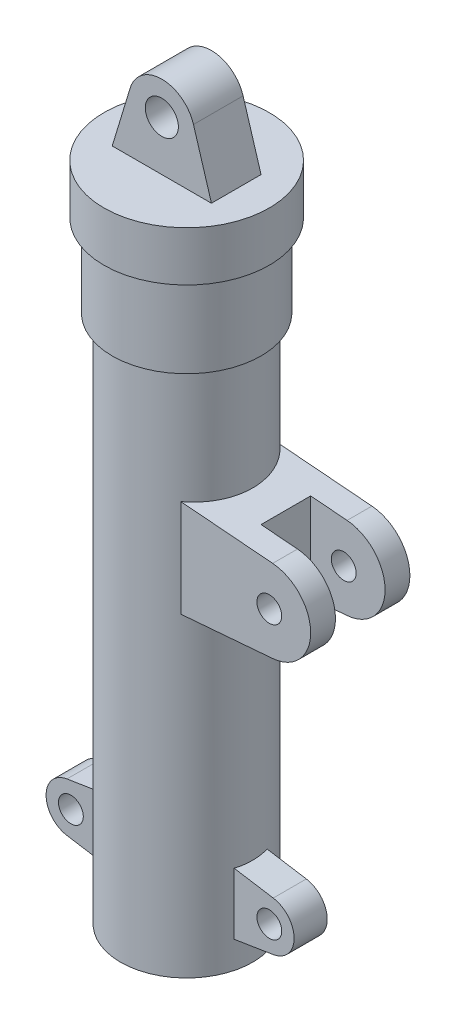
ISO-10303-21;
HEADER;
FILE_DESCRIPTION(('STEP AP214'),'2;1');
FILE_NAME('part.step','',(''),(''),'','','');
FILE_SCHEMA(('AUTOMOTIVE_DESIGN { 1 0 10303 214 1 1 1 1 }'));
ENDSEC;
DATA;
#1=APPLICATION_CONTEXT('core data for automotive mechanical design processes');
#2=APPLICATION_PROTOCOL_DEFINITION('international standard','automotive_design',2000,#1);
#3=PRODUCT_CONTEXT('',#1,'mechanical');
#4=PRODUCT('Part','Part','',(#3));
#5=PRODUCT_RELATED_PRODUCT_CATEGORY('part','',(#4));
#6=PRODUCT_DEFINITION_FORMATION('','',#4);
#7=PRODUCT_DEFINITION_CONTEXT('part definition',#1,'design');
#8=PRODUCT_DEFINITION('design','',#6,#7);
#9=PRODUCT_DEFINITION_SHAPE('','',#8);
#10=(LENGTH_UNIT() NAMED_UNIT(*) SI_UNIT(.MILLI.,.METRE.));
#11=(NAMED_UNIT(*) PLANE_ANGLE_UNIT() SI_UNIT($,.RADIAN.));
#12=(NAMED_UNIT(*) SI_UNIT($,.STERADIAN.) SOLID_ANGLE_UNIT());
#13=UNCERTAINTY_MEASURE_WITH_UNIT(LENGTH_MEASURE(1.E-05),#10,'distance_accuracy_value','');
#14=(GEOMETRIC_REPRESENTATION_CONTEXT(3) GLOBAL_UNCERTAINTY_ASSIGNED_CONTEXT((#13)) GLOBAL_UNIT_ASSIGNED_CONTEXT((#10,
#11,#12)) REPRESENTATION_CONTEXT('',''));
#15=CARTESIAN_POINT('',(0.,0.,0.));
#16=DIRECTION('',(0.,0.,1.));
#17=DIRECTION('',(1.,0.,0.));
#18=AXIS2_PLACEMENT_3D('',#15,#16,#17);
#19=CARTESIAN_POINT('',(80.,-110.,30.));
#20=DIRECTION('',(0.,0.,-1.));
#21=DIRECTION('',(-1.,0.,0.));
#22=AXIS2_PLACEMENT_3D('',#19,#20,#21);
#23=CYLINDRICAL_SURFACE('',#22,25.);
#24=DIRECTION('',(0.,0.,-1.));
#25=VECTOR('',#24,1.);
#26=CARTESIAN_POINT('',(82.0415829983239,-134.916499329981,30.));
#27=LINE('',#26,#25);
#28=CARTESIAN_POINT('',(82.0415829983239,-134.916499329981,30.));
#29=VERTEX_POINT('',#28);
#30=CARTESIAN_POINT('',(82.0415829983239,-134.916499329981,15.));
#31=VERTEX_POINT('',#30);
#32=EDGE_CURVE('E238',#29,#31,#27,.T.);
#33=ORIENTED_EDGE('',*,*,#32,.T.);
#34=CARTESIAN_POINT('',(80.,-110.,15.));
#35=DIRECTION('',(0.,0.,-1.));
#36=DIRECTION('',(-1.,0.,0.));
#37=AXIS2_PLACEMENT_3D('',#34,#35,#36);
#38=CIRCLE('',#37,25.);
#39=CARTESIAN_POINT('',(82.0415829983239,-85.0835006700188,15.));
#40=VERTEX_POINT('',#39);
#41=EDGE_CURVE('E198',#31,#40,#38,.F.);
#42=ORIENTED_EDGE('',*,*,#41,.T.);
#43=DIRECTION('',(0.,0.,-1.));
#44=VECTOR('',#43,1.);
#45=CARTESIAN_POINT('',(82.0415829983239,-85.0835006700188,30.));
#46=LINE('',#45,#44);
#47=CARTESIAN_POINT('',(82.0415829983239,-85.0835006700188,30.));
#48=VERTEX_POINT('',#47);
#49=EDGE_CURVE('E197',#48,#40,#46,.T.);
#50=ORIENTED_EDGE('',*,*,#49,.F.);
#51=CARTESIAN_POINT('',(80.,-110.,30.));
#52=DIRECTION('',(0.,0.,-1.));
#53=DIRECTION('',(-1.,0.,0.));
#54=AXIS2_PLACEMENT_3D('',#51,#52,#53);
#55=CIRCLE('',#54,25.);
#56=EDGE_CURVE('E223',#48,#29,#55,.T.);
#57=ORIENTED_EDGE('',*,*,#56,.T.);
#58=EDGE_LOOP('',(#33,#42,#50,#57));
#59=FACE_BOUND('',#58,.T.);
#60=ADVANCED_FACE('F46',(#59),#23,.T.);
#61=CARTESIAN_POINT('',(80.,-110.,30.));
#62=DIRECTION('',(0.,0.,-1.));
#63=DIRECTION('',(-1.,0.,0.));
#64=AXIS2_PLACEMENT_3D('',#61,#62,#63);
#65=CYLINDRICAL_SURFACE('',#64,7.5);
#66=CARTESIAN_POINT('',(80.,-110.,30.));
#67=DIRECTION('',(0.,0.,1.));
#68=DIRECTION('',(1.,0.,0.));
#69=AXIS2_PLACEMENT_3D('',#66,#67,#68);
#70=CIRCLE('',#69,7.5);
#71=CARTESIAN_POINT('',(87.5,-110.,30.));
#72=VERTEX_POINT('',#71);
#73=EDGE_CURVE('E215',#72,#72,#70,.T.);
#74=ORIENTED_EDGE('',*,*,#73,.T.);
#75=EDGE_LOOP('',(#74));
#76=FACE_BOUND('',#75,.T.);
#77=CARTESIAN_POINT('',(80.,-110.,15.));
#78=DIRECTION('',(0.,0.,-1.));
#79=DIRECTION('',(-1.,0.,0.));
#80=AXIS2_PLACEMENT_3D('',#77,#78,#79);
#81=CIRCLE('',#80,7.5);
#82=CARTESIAN_POINT('',(72.5,-110.,15.));
#83=VERTEX_POINT('',#82);
#84=EDGE_CURVE('E202',#83,#83,#81,.T.);
#85=ORIENTED_EDGE('',*,*,#84,.T.);
#86=EDGE_LOOP('',(#85));
#87=FACE_BOUND('',#86,.T.);
#88=ADVANCED_FACE('F407',(#76,#87),#65,.F.);
#89=CARTESIAN_POINT('',(0.,100.,0.));
#90=DIRECTION('',(0.,1.,0.));
#91=DIRECTION('',(0.,0.,1.));
#92=AXIS2_PLACEMENT_3D('',#89,#90,#91);
#93=CYLINDRICAL_SURFACE('',#92,40.);
#94=CARTESIAN_POINT('',(0.,-330.,0.));
#95=DIRECTION('',(0.,1.,0.));
#96=DIRECTION('',(0.,0.,1.));
#97=AXIS2_PLACEMENT_3D('',#94,#95,#96);
#98=CIRCLE('',#97,39.9999999999999);
#99=CARTESIAN_POINT('',(0.,-330.,39.9999999999999));
#100=VERTEX_POINT('',#99);
#101=EDGE_CURVE('E385',#100,#100,#98,.T.);
#102=ORIENTED_EDGE('',*,*,#101,.T.);
#103=EDGE_LOOP('',(#102));
#104=FACE_BOUND('',#103,.T.);
#105=CARTESIAN_POINT('',(0.,-9.99999999999999,0.));
#106=DIRECTION('',(0.,1.,0.));
#107=DIRECTION('',(0.,0.,1.));
#108=AXIS2_PLACEMENT_3D('',#105,#106,#107);
#109=CIRCLE('',#108,40.);
#110=CARTESIAN_POINT('',(0.,-9.99999999999999,40.));
#111=VERTEX_POINT('',#110);
#112=EDGE_CURVE('E381',#111,#111,#109,.T.);
#113=ORIENTED_EDGE('',*,*,#112,.F.);
#114=EDGE_LOOP('',(#113));
#115=FACE_BOUND('',#114,.T.);
#116=DIRECTION('',(0.,1.,0.));
#117=VECTOR('',#116,1.);
#118=CARTESIAN_POINT('',(38.7298334620741,100.,-10.));
#119=LINE('',#118,#117);
#120=CARTESIAN_POINT('',(38.7298334620741,-313.600742062039,-10.));
#121=VERTEX_POINT('',#120);
#122=CARTESIAN_POINT('',(38.7298334620742,-276.399257937961,-10.));
#123=VERTEX_POINT('',#122);
#124=EDGE_CURVE('E317',#121,#123,#119,.T.);
#125=ORIENTED_EDGE('',*,*,#124,.F.);
#126=CARTESIAN_POINT('',(0.,-319.808538252327,0.));
#127=DIRECTION('',(-0.158264501869385,0.987396752804077,0.));
#128=DIRECTION('',(0.987396752804077,0.158264501869385,0.));
#129=AXIS2_PLACEMENT_3D('',#126,#127,#128);
#130=ELLIPSE('',#129,40.5105646604622,40.);
#131=CARTESIAN_POINT('',(38.7298334620741,-313.600742062039,10.));
#132=VERTEX_POINT('',#131);
#133=EDGE_CURVE('E314',#121,#132,#130,.F.);
#134=ORIENTED_EDGE('',*,*,#133,.T.);
#135=DIRECTION('',(0.,1.,0.));
#136=VECTOR('',#135,1.);
#137=CARTESIAN_POINT('',(38.7298334620741,100.,10.));
#138=LINE('',#137,#136);
#139=CARTESIAN_POINT('',(38.7298334620742,-276.399257937961,10.));
#140=VERTEX_POINT('',#139);
#141=EDGE_CURVE('E320',#132,#140,#138,.T.);
#142=ORIENTED_EDGE('',*,*,#141,.T.);
#143=CARTESIAN_POINT('',(0.,-270.191461747673,0.));
#144=DIRECTION('',(-0.158264501869385,-0.987396752804077,0.));
#145=DIRECTION('',(-0.987396752804077,0.158264501869385,0.));
#146=AXIS2_PLACEMENT_3D('',#143,#144,#145);
#147=ELLIPSE('',#146,40.5105646604622,40.);
#148=EDGE_CURVE('E311',#140,#123,#147,.F.);
#149=ORIENTED_EDGE('',*,*,#148,.T.);
#150=EDGE_LOOP('',(#125,#134,#142,#149));
#151=FACE_BOUND('',#150,.T.);
#152=CARTESIAN_POINT('',(0.,-270.191461747673,0.));
#153=DIRECTION('',(-0.158264501869385,0.987396752804077,0.));
#154=DIRECTION('',(0.987396752804077,0.158264501869385,0.));
#155=AXIS2_PLACEMENT_3D('',#152,#153,#154);
#156=ELLIPSE('',#155,40.5105646604622,40.);
#157=CARTESIAN_POINT('',(-38.7298334620742,-276.399257937961,10.));
#158=VERTEX_POINT('',#157);
#159=CARTESIAN_POINT('',(-38.7298334620741,-276.399257937961,-10.));
#160=VERTEX_POINT('',#159);
#161=EDGE_CURVE('E282',#158,#160,#156,.F.);
#162=ORIENTED_EDGE('',*,*,#161,.F.);
#163=DIRECTION('',(0.,1.,0.));
#164=VECTOR('',#163,1.);
#165=CARTESIAN_POINT('',(-38.7298334620741,100.,10.));
#166=LINE('',#165,#164);
#167=CARTESIAN_POINT('',(-38.7298334620741,-313.600742062039,10.));
#168=VERTEX_POINT('',#167);
#169=EDGE_CURVE('E277',#158,#168,#166,.F.);
#170=ORIENTED_EDGE('',*,*,#169,.T.);
#171=CARTESIAN_POINT('',(0.,-319.808538252327,0.));
#172=DIRECTION('',(-0.158264501869385,-0.987396752804077,0.));
#173=DIRECTION('',(-0.987396752804077,0.158264501869385,0.));
#174=AXIS2_PLACEMENT_3D('',#171,#172,#173);
#175=ELLIPSE('',#174,40.5105646604622,40.);
#176=CARTESIAN_POINT('',(-38.7298334620741,-313.600742062039,-10.));
#177=VERTEX_POINT('',#176);
#178=EDGE_CURVE('E279',#177,#168,#175,.F.);
#179=ORIENTED_EDGE('',*,*,#178,.F.);
#180=DIRECTION('',(0.,1.,0.));
#181=VECTOR('',#180,1.);
#182=CARTESIAN_POINT('',(-38.7298334620741,100.,-10.));
#183=LINE('',#182,#181);
#184=EDGE_CURVE('E274',#160,#177,#183,.F.);
#185=ORIENTED_EDGE('',*,*,#184,.F.);
#186=EDGE_LOOP('',(#162,#170,#179,#185));
#187=FACE_BOUND('',#186,.T.);
#188=DIRECTION('',(0.,1.,0.));
#189=VECTOR('',#188,1.);
#190=CARTESIAN_POINT('',(26.4575131106459,100.,-30.));
#191=LINE('',#190,#189);
#192=CARTESIAN_POINT('',(26.4575131106459,-139.470890801972,-30.));
#193=VERTEX_POINT('',#192);
#194=CARTESIAN_POINT('',(26.4575131106458,-80.5291091980279,-30.));
#195=VERTEX_POINT('',#194);
#196=EDGE_CURVE('E391',#193,#195,#191,.T.);
#197=ORIENTED_EDGE('',*,*,#196,.F.);
#198=CARTESIAN_POINT('',(0.,-141.638739833623,0.));
#199=DIRECTION('',(-0.0816633199329569,0.996659973199249,0.));
#200=DIRECTION('',(0.996659973199249,0.0816633199329569,0.));
#201=AXIS2_PLACEMENT_3D('',#198,#199,#200);
#202=ELLIPSE('',#201,40.13404879861,40.);
#203=CARTESIAN_POINT('',(26.4575131106459,-139.470890801972,30.));
#204=VERTEX_POINT('',#203);
#205=EDGE_CURVE('E244',#193,#204,#202,.F.);
#206=ORIENTED_EDGE('',*,*,#205,.T.);
#207=DIRECTION('',(0.,1.,0.));
#208=VECTOR('',#207,1.);
#209=CARTESIAN_POINT('',(26.4575131106459,100.,30.));
#210=LINE('',#209,#208);
#211=CARTESIAN_POINT('',(26.4575131106458,-80.5291091980279,30.));
#212=VERTEX_POINT('',#211);
#213=EDGE_CURVE('E54',#204,#212,#210,.T.);
#214=ORIENTED_EDGE('',*,*,#213,.T.);
#215=CARTESIAN_POINT('',(0.,-78.361260166377,0.));
#216=DIRECTION('',(-0.0816633199329582,-0.996659973199249,0.));
#217=DIRECTION('',(-0.996659973199249,0.0816633199329582,0.));
#218=AXIS2_PLACEMENT_3D('',#215,#216,#217);
#219=ELLIPSE('',#218,40.13404879861,40.);
#220=EDGE_CURVE('E241',#212,#195,#219,.F.);
#221=ORIENTED_EDGE('',*,*,#220,.T.);
#222=EDGE_LOOP('',(#197,#206,#214,#221));
#223=FACE_BOUND('',#222,.T.);
#224=ADVANCED_FACE('F430',(#104,#115,#151,#187,#223),#93,.T.);
#225=CARTESIAN_POINT('',(0.,100.,0.));
#226=DIRECTION('',(0.,1.,0.));
#227=DIRECTION('',(0.,0.,1.));
#228=AXIS2_PLACEMENT_3D('',#225,#226,#227);
#229=CYLINDRICAL_SURFACE('',#228,35.);
#230=CARTESIAN_POINT('',(0.,55.,0.));
#231=DIRECTION('',(0.,1.,0.));
#232=DIRECTION('',(0.,0.,1.));
#233=AXIS2_PLACEMENT_3D('',#230,#231,#232);
#234=CIRCLE('',#233,35.);
#235=CARTESIAN_POINT('',(0.,55.,35.));
#236=VERTEX_POINT('',#235);
#237=EDGE_CURVE('E366',#236,#236,#234,.T.);
#238=ORIENTED_EDGE('',*,*,#237,.T.);
#239=EDGE_LOOP('',(#238));
#240=FACE_BOUND('',#239,.T.);
#241=CARTESIAN_POINT('',(0.,-325.,0.));
#242=DIRECTION('',(0.,1.,0.));
#243=DIRECTION('',(0.,0.,1.));
#244=AXIS2_PLACEMENT_3D('',#241,#242,#243);
#245=CIRCLE('',#244,35.);
#246=CARTESIAN_POINT('',(0.,-325.,35.));
#247=VERTEX_POINT('',#246);
#248=EDGE_CURVE('E363',#247,#247,#245,.T.);
#249=ORIENTED_EDGE('',*,*,#248,.F.);
#250=EDGE_LOOP('',(#249));
#251=FACE_BOUND('',#250,.T.);
#252=ADVANCED_FACE('F514',(#240,#251),#229,.F.);
#253=CARTESIAN_POINT('',(0.,100.,0.));
#254=DIRECTION('',(0.,1.,0.));
#255=DIRECTION('',(0.,0.,1.));
#256=AXIS2_PLACEMENT_3D('',#253,#254,#255);
#257=CYLINDRICAL_SURFACE('',#256,22.5);
#258=CARTESIAN_POINT('',(0.,-325.,0.));
#259=DIRECTION('',(0.,1.,0.));
#260=DIRECTION('',(0.,0.,1.));
#261=AXIS2_PLACEMENT_3D('',#258,#259,#260);
#262=CIRCLE('',#261,22.5);
#263=CARTESIAN_POINT('',(0.,-325.,22.5));
#264=VERTEX_POINT('',#263);
#265=EDGE_CURVE('E354',#264,#264,#262,.T.);
#266=ORIENTED_EDGE('',*,*,#265,.T.);
#267=EDGE_LOOP('',(#266));
#268=FACE_BOUND('',#267,.T.);
#269=CARTESIAN_POINT('',(0.,-330.,0.));
#270=DIRECTION('',(0.,1.,0.));
#271=DIRECTION('',(0.,0.,1.));
#272=AXIS2_PLACEMENT_3D('',#269,#270,#271);
#273=CIRCLE('',#272,22.5);
#274=CARTESIAN_POINT('',(0.,-330.,22.5));
#275=VERTEX_POINT('',#274);
#276=EDGE_CURVE('E388',#275,#275,#273,.T.);
#277=ORIENTED_EDGE('',*,*,#276,.F.);
#278=EDGE_LOOP('',(#277));
#279=FACE_BOUND('',#278,.T.);
#280=ADVANCED_FACE('F48',(#268,#279),#257,.F.);
#281=CARTESIAN_POINT('',(22.5,-330.,0.));
#282=DIRECTION('',(0.,1.,0.));
#283=DIRECTION('',(0.,0.,1.));
#284=AXIS2_PLACEMENT_3D('',#281,#282,#283);
#285=PLANE('',#284);
#286=ORIENTED_EDGE('',*,*,#101,.F.);
#287=EDGE_LOOP('',(#286));
#288=FACE_BOUND('',#287,.T.);
#289=ORIENTED_EDGE('',*,*,#276,.T.);
#290=EDGE_LOOP('',(#289));
#291=FACE_BOUND('',#290,.T.);
#292=ADVANCED_FACE('F540',(#288,#291),#285,.F.);
#293=CARTESIAN_POINT('',(45.,-9.99999999999999,0.));
#294=DIRECTION('',(0.,-1.,0.));
#295=DIRECTION('',(0.,0.,-1.));
#296=AXIS2_PLACEMENT_3D('',#293,#294,#295);
#297=PLANE('',#296);
#298=ORIENTED_EDGE('',*,*,#112,.T.);
#299=EDGE_LOOP('',(#298));
#300=FACE_BOUND('',#299,.T.);
#301=CARTESIAN_POINT('',(0.,-9.99999999999999,0.));
#302=DIRECTION('',(0.,1.,0.));
#303=DIRECTION('',(0.,0.,1.));
#304=AXIS2_PLACEMENT_3D('',#301,#302,#303);
#305=CIRCLE('',#304,45.);
#306=CARTESIAN_POINT('',(0.,-9.99999999999999,45.));
#307=VERTEX_POINT('',#306);
#308=EDGE_CURVE('E378',#307,#307,#305,.T.);
#309=ORIENTED_EDGE('',*,*,#308,.F.);
#310=EDGE_LOOP('',(#309));
#311=FACE_BOUND('',#310,.T.);
#312=ADVANCED_FACE('F536',(#300,#311),#297,.T.);
#313=CARTESIAN_POINT('',(0.,100.,0.));
#314=DIRECTION('',(0.,1.,0.));
#315=DIRECTION('',(0.,0.,1.));
#316=AXIS2_PLACEMENT_3D('',#313,#314,#315);
#317=CYLINDRICAL_SURFACE('',#316,45.);
#318=CARTESIAN_POINT('',(0.,40.,0.));
#319=DIRECTION('',(0.,1.,0.));
#320=DIRECTION('',(0.,0.,1.));
#321=AXIS2_PLACEMENT_3D('',#318,#319,#320);
#322=CIRCLE('',#321,45.);
#323=CARTESIAN_POINT('',(0.,40.,45.));
#324=VERTEX_POINT('',#323);
#325=EDGE_CURVE('E375',#324,#324,#322,.T.);
#326=ORIENTED_EDGE('',*,*,#325,.F.);
#327=EDGE_LOOP('',(#326));
#328=FACE_BOUND('',#327,.T.);
#329=ORIENTED_EDGE('',*,*,#308,.T.);
#330=EDGE_LOOP('',(#329));
#331=FACE_BOUND('',#330,.T.);
#332=ADVANCED_FACE('F532',(#328,#331),#317,.T.);
#333=CARTESIAN_POINT('',(50.,40.,0.));
#334=DIRECTION('',(0.,-1.,0.));
#335=DIRECTION('',(0.,0.,-1.));
#336=AXIS2_PLACEMENT_3D('',#333,#334,#335);
#337=PLANE('',#336);
#338=ORIENTED_EDGE('',*,*,#325,.T.);
#339=EDGE_LOOP('',(#338));
#340=FACE_BOUND('',#339,.T.);
#341=CARTESIAN_POINT('',(0.,40.,0.));
#342=DIRECTION('',(0.,1.,0.));
#343=DIRECTION('',(0.,0.,1.));
#344=AXIS2_PLACEMENT_3D('',#341,#342,#343);
#345=CIRCLE('',#344,50.);
#346=CARTESIAN_POINT('',(0.,40.,50.));
#347=VERTEX_POINT('',#346);
#348=EDGE_CURVE('E372',#347,#347,#345,.T.);
#349=ORIENTED_EDGE('',*,*,#348,.F.);
#350=EDGE_LOOP('',(#349));
#351=FACE_BOUND('',#350,.T.);
#352=ADVANCED_FACE('F528',(#340,#351),#337,.T.);
#353=CARTESIAN_POINT('',(0.,100.,0.));
#354=DIRECTION('',(0.,1.,0.));
#355=DIRECTION('',(0.,0.,1.));
#356=AXIS2_PLACEMENT_3D('',#353,#354,#355);
#357=CYLINDRICAL_SURFACE('',#356,50.);
#358=CARTESIAN_POINT('',(0.,70.,0.));
#359=DIRECTION('',(0.,1.,0.));
#360=DIRECTION('',(0.,0.,1.));
#361=AXIS2_PLACEMENT_3D('',#358,#359,#360);
#362=CIRCLE('',#361,50.);
#363=CARTESIAN_POINT('',(0.,70.,50.));
#364=VERTEX_POINT('',#363);
#365=EDGE_CURVE('E369',#364,#364,#362,.T.);
#366=ORIENTED_EDGE('',*,*,#365,.F.);
#367=EDGE_LOOP('',(#366));
#368=FACE_BOUND('',#367,.T.);
#369=ORIENTED_EDGE('',*,*,#348,.T.);
#370=EDGE_LOOP('',(#369));
#371=FACE_BOUND('',#370,.T.);
#372=ADVANCED_FACE('F524',(#368,#371),#357,.T.);
#373=CARTESIAN_POINT('',(50.,70.,0.));
#374=DIRECTION('',(0.,-1.,0.));
#375=DIRECTION('',(0.,0.,-1.));
#376=AXIS2_PLACEMENT_3D('',#373,#374,#375);
#377=PLANE('',#376);
#378=DIRECTION('',(-1.,0.,0.));
#379=VECTOR('',#378,1.);
#380=CARTESIAN_POINT('',(30.,70.,-15.));
#381=LINE('',#380,#379);
#382=CARTESIAN_POINT('',(30.,70.,-15.));
#383=VERTEX_POINT('',#382);
#384=CARTESIAN_POINT('',(-30.,70.,-15.));
#385=VERTEX_POINT('',#384);
#386=EDGE_CURVE('E327',#383,#385,#381,.T.);
#387=ORIENTED_EDGE('',*,*,#386,.F.);
#388=DIRECTION('',(0.,0.,-1.));
#389=VECTOR('',#388,1.);
#390=CARTESIAN_POINT('',(30.,70.,15.));
#391=LINE('',#390,#389);
#392=CARTESIAN_POINT('',(30.,70.,15.));
#393=VERTEX_POINT('',#392);
#394=EDGE_CURVE('E351',#393,#383,#391,.T.);
#395=ORIENTED_EDGE('',*,*,#394,.F.);
#396=DIRECTION('',(-1.,0.,0.));
#397=VECTOR('',#396,1.);
#398=CARTESIAN_POINT('',(30.,70.,15.));
#399=LINE('',#398,#397);
#400=CARTESIAN_POINT('',(-30.,70.,15.));
#401=VERTEX_POINT('',#400);
#402=EDGE_CURVE('E330',#393,#401,#399,.T.);
#403=ORIENTED_EDGE('',*,*,#402,.T.);
#404=DIRECTION('',(0.,0.,-1.));
#405=VECTOR('',#404,1.);
#406=CARTESIAN_POINT('',(-30.,70.,15.));
#407=LINE('',#406,#405);
#408=EDGE_CURVE('E341',#401,#385,#407,.T.);
#409=ORIENTED_EDGE('',*,*,#408,.T.);
#410=EDGE_LOOP('',(#387,#395,#403,#409));
#411=FACE_BOUND('',#410,.T.);
#412=ORIENTED_EDGE('',*,*,#365,.T.);
#413=EDGE_LOOP('',(#412));
#414=FACE_BOUND('',#413,.T.);
#415=ADVANCED_FACE('F520',(#411,#414),#377,.F.);
#416=CARTESIAN_POINT('',(35.,55.,0.));
#417=DIRECTION('',(0.,-1.,0.));
#418=DIRECTION('',(0.,0.,-1.));
#419=AXIS2_PLACEMENT_3D('',#416,#417,#418);
#420=PLANE('',#419);
#421=ORIENTED_EDGE('',*,*,#237,.F.);
#422=EDGE_LOOP('',(#421));
#423=FACE_BOUND('',#422,.T.);
#424=ADVANCED_FACE('F512',(#423),#420,.T.);
#425=CARTESIAN_POINT('',(22.5,-325.,0.));
#426=DIRECTION('',(0.,1.,0.));
#427=DIRECTION('',(0.,0.,1.));
#428=AXIS2_PLACEMENT_3D('',#425,#426,#427);
#429=PLANE('',#428);
#430=ORIENTED_EDGE('',*,*,#248,.T.);
#431=EDGE_LOOP('',(#430));
#432=FACE_BOUND('',#431,.T.);
#433=ORIENTED_EDGE('',*,*,#265,.F.);
#434=EDGE_LOOP('',(#433));
#435=FACE_BOUND('',#434,.T.);
#436=ADVANCED_FACE('F494',(#432,#435),#429,.T.);
#437=CARTESIAN_POINT('',(0.,100.,15.));
#438=DIRECTION('',(0.,0.,1.));
#439=DIRECTION('',(1.,0.,0.));
#440=AXIS2_PLACEMENT_3D('',#437,#438,#439);
#441=PLANE('',#440);
#442=ORIENTED_EDGE('',*,*,#402,.F.);
#443=DIRECTION('',(0.29027623112899,-0.956942897795657,0.));
#444=VECTOR('',#443,1.);
#445=CARTESIAN_POINT('',(19.1388579559131,105.80552462258,15.));
#446=LINE('',#445,#444);
#447=CARTESIAN_POINT('',(19.1388579559131,105.80552462258,15.));
#448=VERTEX_POINT('',#447);
#449=EDGE_CURVE('E338',#448,#393,#446,.T.);
#450=ORIENTED_EDGE('',*,*,#449,.F.);
#451=CARTESIAN_POINT('',(0.,100.,15.));
#452=DIRECTION('',(0.,0.,1.));
#453=DIRECTION('',(1.,0.,0.));
#454=AXIS2_PLACEMENT_3D('',#451,#452,#453);
#455=CIRCLE('',#454,20.);
#456=CARTESIAN_POINT('',(-19.1388579559131,105.80552462258,15.));
#457=VERTEX_POINT('',#456);
#458=EDGE_CURVE('E336',#448,#457,#455,.T.);
#459=ORIENTED_EDGE('',*,*,#458,.T.);
#460=DIRECTION('',(-0.29027623112899,-0.956942897795657,0.));
#461=VECTOR('',#460,1.);
#462=CARTESIAN_POINT('',(-19.1388579559131,105.80552462258,15.));
#463=LINE('',#462,#461);
#464=EDGE_CURVE('E332',#457,#401,#463,.T.);
#465=ORIENTED_EDGE('',*,*,#464,.T.);
#466=EDGE_LOOP('',(#442,#450,#459,#465));
#467=FACE_BOUND('',#466,.T.);
#468=CARTESIAN_POINT('',(0.,100.,15.));
#469=DIRECTION('',(0.,0.,1.));
#470=DIRECTION('',(1.,0.,0.));
#471=AXIS2_PLACEMENT_3D('',#468,#469,#470);
#472=CIRCLE('',#471,10.);
#473=CARTESIAN_POINT('',(10.,100.,15.));
#474=VERTEX_POINT('',#473);
#475=EDGE_CURVE('E324',#474,#474,#472,.T.);
#476=ORIENTED_EDGE('',*,*,#475,.F.);
#477=EDGE_LOOP('',(#476));
#478=FACE_BOUND('',#477,.T.);
#479=ADVANCED_FACE('F490',(#467,#478),#441,.T.);
#480=CARTESIAN_POINT('',(0.,100.,-15.));
#481=DIRECTION('',(0.,0.,1.));
#482=DIRECTION('',(1.,0.,0.));
#483=AXIS2_PLACEMENT_3D('',#480,#481,#482);
#484=PLANE('',#483);
#485=ORIENTED_EDGE('',*,*,#386,.T.);
#486=DIRECTION('',(-0.29027623112899,-0.956942897795657,0.));
#487=VECTOR('',#486,1.);
#488=CARTESIAN_POINT('',(-19.1388579559131,105.80552462258,-15.));
#489=LINE('',#488,#487);
#490=CARTESIAN_POINT('',(-19.1388579559131,105.80552462258,-15.));
#491=VERTEX_POINT('',#490);
#492=EDGE_CURVE('E344',#491,#385,#489,.T.);
#493=ORIENTED_EDGE('',*,*,#492,.F.);
#494=CARTESIAN_POINT('',(0.,100.,-15.));
#495=DIRECTION('',(0.,0.,1.));
#496=DIRECTION('',(1.,0.,0.));
#497=AXIS2_PLACEMENT_3D('',#494,#495,#496);
#498=CIRCLE('',#497,20.);
#499=CARTESIAN_POINT('',(19.1388579559131,105.80552462258,-15.));
#500=VERTEX_POINT('',#499);
#501=EDGE_CURVE('E347',#500,#491,#498,.T.);
#502=ORIENTED_EDGE('',*,*,#501,.F.);
#503=DIRECTION('',(0.29027623112899,-0.956942897795657,0.));
#504=VECTOR('',#503,1.);
#505=CARTESIAN_POINT('',(19.1388579559131,105.80552462258,-15.));
#506=LINE('',#505,#504);
#507=EDGE_CURVE('E333',#500,#383,#506,.T.);
#508=ORIENTED_EDGE('',*,*,#507,.T.);
#509=EDGE_LOOP('',(#485,#493,#502,#508));
#510=FACE_BOUND('',#509,.T.);
#511=CARTESIAN_POINT('',(0.,100.,-15.));
#512=DIRECTION('',(0.,0.,1.));
#513=DIRECTION('',(1.,0.,0.));
#514=AXIS2_PLACEMENT_3D('',#511,#512,#513);
#515=CIRCLE('',#514,10.);
#516=CARTESIAN_POINT('',(10.,100.,-15.));
#517=VERTEX_POINT('',#516);
#518=EDGE_CURVE('E323',#517,#517,#515,.T.);
#519=ORIENTED_EDGE('',*,*,#518,.T.);
#520=EDGE_LOOP('',(#519));
#521=FACE_BOUND('',#520,.T.);
#522=ADVANCED_FACE('F493',(#510,#521),#484,.F.);
#523=CARTESIAN_POINT('',(19.1388579559131,105.80552462258,15.));
#524=DIRECTION('',(0.956942897795657,0.29027623112899,0.));
#525=DIRECTION('',(-0.29027623112899,0.956942897795657,0.));
#526=AXIS2_PLACEMENT_3D('',#523,#524,#525);
#527=PLANE('',#526);
#528=ORIENTED_EDGE('',*,*,#507,.F.);
#529=DIRECTION('',(0.,0.,-1.));
#530=VECTOR('',#529,1.);
#531=CARTESIAN_POINT('',(19.1388579559131,105.80552462258,15.));
#532=LINE('',#531,#530);
#533=EDGE_CURVE('E355',#448,#500,#532,.T.);
#534=ORIENTED_EDGE('',*,*,#533,.F.);
#535=ORIENTED_EDGE('',*,*,#449,.T.);
#536=ORIENTED_EDGE('',*,*,#394,.T.);
#537=EDGE_LOOP('',(#528,#534,#535,#536));
#538=FACE_BOUND('',#537,.T.);
#539=ADVANCED_FACE('F498',(#538),#527,.T.);
#540=CARTESIAN_POINT('',(0.,100.,15.));
#541=DIRECTION('',(0.,0.,-1.));
#542=DIRECTION('',(-1.,0.,0.));
#543=AXIS2_PLACEMENT_3D('',#540,#541,#542);
#544=CYLINDRICAL_SURFACE('',#543,20.);
#545=ORIENTED_EDGE('',*,*,#501,.T.);
#546=DIRECTION('',(0.,0.,-1.));
#547=VECTOR('',#546,1.);
#548=CARTESIAN_POINT('',(-19.1388579559131,105.80552462258,15.));
#549=LINE('',#548,#547);
#550=EDGE_CURVE('E357',#457,#491,#549,.T.);
#551=ORIENTED_EDGE('',*,*,#550,.F.);
#552=ORIENTED_EDGE('',*,*,#458,.F.);
#553=ORIENTED_EDGE('',*,*,#533,.T.);
#554=EDGE_LOOP('',(#545,#551,#552,#553));
#555=FACE_BOUND('',#554,.T.);
#556=ADVANCED_FACE('F502',(#555),#544,.T.);
#557=CARTESIAN_POINT('',(-19.1388579559131,105.80552462258,15.));
#558=DIRECTION('',(0.956942897795657,-0.29027623112899,0.));
#559=DIRECTION('',(0.29027623112899,0.956942897795657,0.));
#560=AXIS2_PLACEMENT_3D('',#557,#558,#559);
#561=PLANE('',#560);
#562=ORIENTED_EDGE('',*,*,#492,.T.);
#563=ORIENTED_EDGE('',*,*,#408,.F.);
#564=ORIENTED_EDGE('',*,*,#464,.F.);
#565=ORIENTED_EDGE('',*,*,#550,.T.);
#566=EDGE_LOOP('',(#562,#563,#564,#565));
#567=FACE_BOUND('',#566,.T.);
#568=ADVANCED_FACE('F488',(#567),#561,.F.);
#569=CARTESIAN_POINT('',(0.,100.,15.));
#570=DIRECTION('',(0.,0.,-1.));
#571=DIRECTION('',(-1.,0.,0.));
#572=AXIS2_PLACEMENT_3D('',#569,#570,#571);
#573=CYLINDRICAL_SURFACE('',#572,10.);
#574=ORIENTED_EDGE('',*,*,#475,.T.);
#575=EDGE_LOOP('',(#574));
#576=FACE_BOUND('',#575,.T.);
#577=ORIENTED_EDGE('',*,*,#518,.F.);
#578=EDGE_LOOP('',(#577));
#579=FACE_BOUND('',#578,.T.);
#580=ADVANCED_FACE('F470',(#576,#579),#573,.F.);
#581=CARTESIAN_POINT('',(59.9999999999999,-295.,10.));
#582=DIRECTION('',(0.,0.,-1.));
#583=DIRECTION('',(-1.,0.,0.));
#584=AXIS2_PLACEMENT_3D('',#581,#582,#583);
#585=PLANE('',#584);
#586=ORIENTED_EDGE('',*,*,#141,.F.);
#587=DIRECTION('',(0.987396752804077,0.158264501869385,0.));
#588=VECTOR('',#587,1.);
#589=CARTESIAN_POINT('',(30.,-315.,10.));
#590=LINE('',#589,#588);
#591=CARTESIAN_POINT('',(62.3739675280407,-309.810951292061,10.));
#592=VERTEX_POINT('',#591);
#593=EDGE_CURVE('E292',#132,#592,#590,.T.);
#594=ORIENTED_EDGE('',*,*,#593,.T.);
#595=CARTESIAN_POINT('',(59.9999999999999,-295.,10.));
#596=DIRECTION('',(0.,0.,-1.));
#597=DIRECTION('',(-1.,0.,0.));
#598=AXIS2_PLACEMENT_3D('',#595,#596,#597);
#599=CIRCLE('',#598,15.);
#600=CARTESIAN_POINT('',(62.3739675280407,-280.189048707939,10.));
#601=VERTEX_POINT('',#600);
#602=EDGE_CURVE('E294',#601,#592,#599,.T.);
#603=ORIENTED_EDGE('',*,*,#602,.F.);
#604=DIRECTION('',(-0.987396752804077,0.158264501869385,0.));
#605=VECTOR('',#604,1.);
#606=CARTESIAN_POINT('',(62.3739675280407,-280.189048707939,10.));
#607=LINE('',#606,#605);
#608=EDGE_CURVE('E298',#601,#140,#607,.T.);
#609=ORIENTED_EDGE('',*,*,#608,.T.);
#610=EDGE_LOOP('',(#586,#594,#603,#609));
#611=FACE_BOUND('',#610,.T.);
#612=CARTESIAN_POINT('',(59.9999999999999,-295.,10.));
#613=DIRECTION('',(0.,0.,1.));
#614=DIRECTION('',(1.,0.,0.));
#615=AXIS2_PLACEMENT_3D('',#612,#613,#614);
#616=CIRCLE('',#615,7.5);
#617=CARTESIAN_POINT('',(67.4999999999999,-295.,10.));
#618=VERTEX_POINT('',#617);
#619=EDGE_CURVE('E286',#618,#618,#616,.T.);
#620=ORIENTED_EDGE('',*,*,#619,.F.);
#621=EDGE_LOOP('',(#620));
#622=FACE_BOUND('',#621,.T.);
#623=ADVANCED_FACE('F466',(#611,#622),#585,.F.);
#624=CARTESIAN_POINT('',(59.9999999999999,-295.,-10.));
#625=DIRECTION('',(0.,0.,-1.));
#626=DIRECTION('',(-1.,0.,0.));
#627=AXIS2_PLACEMENT_3D('',#624,#625,#626);
#628=PLANE('',#627);
#629=CARTESIAN_POINT('',(59.9999999999999,-295.,-10.));
#630=DIRECTION('',(0.,0.,1.));
#631=DIRECTION('',(1.,0.,0.));
#632=AXIS2_PLACEMENT_3D('',#629,#630,#631);
#633=CIRCLE('',#632,7.5);
#634=CARTESIAN_POINT('',(67.4999999999999,-295.,-10.));
#635=VERTEX_POINT('',#634);
#636=EDGE_CURVE('E285',#635,#635,#633,.T.);
#637=ORIENTED_EDGE('',*,*,#636,.T.);
#638=EDGE_LOOP('',(#637));
#639=FACE_BOUND('',#638,.T.);
#640=DIRECTION('',(0.987396752804077,0.158264501869385,0.));
#641=VECTOR('',#640,1.);
#642=CARTESIAN_POINT('',(30.,-315.,-10.));
#643=LINE('',#642,#641);
#644=CARTESIAN_POINT('',(62.3739675280407,-309.810951292061,-10.));
#645=VERTEX_POINT('',#644);
#646=EDGE_CURVE('E289',#121,#645,#643,.T.);
#647=ORIENTED_EDGE('',*,*,#646,.F.);
#648=ORIENTED_EDGE('',*,*,#124,.T.);
#649=DIRECTION('',(-0.987396752804077,0.158264501869385,0.));
#650=VECTOR('',#649,1.);
#651=CARTESIAN_POINT('',(62.3739675280407,-280.189048707939,-10.));
#652=LINE('',#651,#650);
#653=CARTESIAN_POINT('',(62.3739675280407,-280.189048707939,-10.));
#654=VERTEX_POINT('',#653);
#655=EDGE_CURVE('E295',#654,#123,#652,.T.);
#656=ORIENTED_EDGE('',*,*,#655,.F.);
#657=CARTESIAN_POINT('',(59.9999999999999,-295.,-10.));
#658=DIRECTION('',(0.,0.,-1.));
#659=DIRECTION('',(-1.,0.,0.));
#660=AXIS2_PLACEMENT_3D('',#657,#658,#659);
#661=CIRCLE('',#660,15.);
#662=EDGE_CURVE('E303',#654,#645,#661,.T.);
#663=ORIENTED_EDGE('',*,*,#662,.T.);
#664=EDGE_LOOP('',(#647,#648,#656,#663));
#665=FACE_BOUND('',#664,.T.);
#666=ADVANCED_FACE('F469',(#639,#665),#628,.T.);
#667=CARTESIAN_POINT('',(30.,-315.,10.));
#668=DIRECTION('',(-0.158264501869385,0.987396752804077,0.));
#669=DIRECTION('',(-0.987396752804077,-0.158264501869385,0.));
#670=AXIS2_PLACEMENT_3D('',#667,#668,#669);
#671=PLANE('',#670);
#672=ORIENTED_EDGE('',*,*,#133,.F.);
#673=ORIENTED_EDGE('',*,*,#646,.T.);
#674=DIRECTION('',(0.,0.,-1.));
#675=VECTOR('',#674,1.);
#676=CARTESIAN_POINT('',(62.3739675280407,-309.810951292061,10.));
#677=LINE('',#676,#675);
#678=EDGE_CURVE('E308',#592,#645,#677,.T.);
#679=ORIENTED_EDGE('',*,*,#678,.F.);
#680=ORIENTED_EDGE('',*,*,#593,.F.);
#681=EDGE_LOOP('',(#672,#673,#679,#680));
#682=FACE_BOUND('',#681,.T.);
#683=ADVANCED_FACE('F474',(#682),#671,.F.);
#684=CARTESIAN_POINT('',(62.3739675280407,-280.189048707939,10.));
#685=DIRECTION('',(-0.158264501869385,-0.987396752804077,0.));
#686=DIRECTION('',(0.987396752804077,-0.158264501869385,0.));
#687=AXIS2_PLACEMENT_3D('',#684,#685,#686);
#688=PLANE('',#687);
#689=ORIENTED_EDGE('',*,*,#148,.F.);
#690=ORIENTED_EDGE('',*,*,#608,.F.);
#691=DIRECTION('',(0.,0.,-1.));
#692=VECTOR('',#691,1.);
#693=CARTESIAN_POINT('',(62.3739675280407,-280.189048707939,10.));
#694=LINE('',#693,#692);
#695=EDGE_CURVE('E301',#601,#654,#694,.T.);
#696=ORIENTED_EDGE('',*,*,#695,.T.);
#697=ORIENTED_EDGE('',*,*,#655,.T.);
#698=EDGE_LOOP('',(#689,#690,#696,#697));
#699=FACE_BOUND('',#698,.T.);
#700=ADVANCED_FACE('F476',(#699),#688,.F.);
#701=CARTESIAN_POINT('',(59.9999999999999,-295.,10.));
#702=DIRECTION('',(0.,0.,-1.));
#703=DIRECTION('',(-1.,0.,0.));
#704=AXIS2_PLACEMENT_3D('',#701,#702,#703);
#705=CYLINDRICAL_SURFACE('',#704,15.);
#706=ORIENTED_EDGE('',*,*,#662,.F.);
#707=ORIENTED_EDGE('',*,*,#695,.F.);
#708=ORIENTED_EDGE('',*,*,#602,.T.);
#709=ORIENTED_EDGE('',*,*,#678,.T.);
#710=EDGE_LOOP('',(#706,#707,#708,#709));
#711=FACE_BOUND('',#710,.T.);
#712=ADVANCED_FACE('F464',(#711),#705,.T.);
#713=CARTESIAN_POINT('',(59.9999999999999,-295.,10.));
#714=DIRECTION('',(0.,0.,-1.));
#715=DIRECTION('',(-1.,0.,0.));
#716=AXIS2_PLACEMENT_3D('',#713,#714,#715);
#717=CYLINDRICAL_SURFACE('',#716,7.5);
#718=ORIENTED_EDGE('',*,*,#619,.T.);
#719=EDGE_LOOP('',(#718));
#720=FACE_BOUND('',#719,.T.);
#721=ORIENTED_EDGE('',*,*,#636,.F.);
#722=EDGE_LOOP('',(#721));
#723=FACE_BOUND('',#722,.T.);
#724=ADVANCED_FACE('F460',(#720,#723),#717,.F.);
#725=CARTESIAN_POINT('',(-62.3739675280407,-280.189048707939,10.));
#726=DIRECTION('',(-0.158264501869385,0.987396752804077,0.));
#727=DIRECTION('',(-0.987396752804077,-0.158264501869385,0.));
#728=AXIS2_PLACEMENT_3D('',#725,#726,#727);
#729=PLANE('',#728);
#730=DIRECTION('',(0.987396752804077,0.158264501869385,0.));
#731=VECTOR('',#730,1.);
#732=CARTESIAN_POINT('',(-62.3739675280407,-280.189048707939,10.));
#733=LINE('',#732,#731);
#734=CARTESIAN_POINT('',(-62.3739675280407,-280.189048707939,10.));
#735=VERTEX_POINT('',#734);
#736=EDGE_CURVE('E254',#735,#158,#733,.T.);
#737=ORIENTED_EDGE('',*,*,#736,.T.);
#738=ORIENTED_EDGE('',*,*,#161,.T.);
#739=DIRECTION('',(0.987396752804077,0.158264501869385,0.));
#740=VECTOR('',#739,1.);
#741=CARTESIAN_POINT('',(-62.3739675280407,-280.189048707939,-10.));
#742=LINE('',#741,#740);
#743=CARTESIAN_POINT('',(-62.3739675280407,-280.189048707939,-10.));
#744=VERTEX_POINT('',#743);
#745=EDGE_CURVE('E251',#744,#160,#742,.T.);
#746=ORIENTED_EDGE('',*,*,#745,.F.);
#747=DIRECTION('',(0.,0.,-1.));
#748=VECTOR('',#747,1.);
#749=CARTESIAN_POINT('',(-62.3739675280407,-280.189048707939,10.));
#750=LINE('',#749,#748);
#751=EDGE_CURVE('E272',#735,#744,#750,.T.);
#752=ORIENTED_EDGE('',*,*,#751,.F.);
#753=EDGE_LOOP('',(#737,#738,#746,#752));
#754=FACE_BOUND('',#753,.T.);
#755=ADVANCED_FACE('F453',(#754),#729,.T.);
#756=CARTESIAN_POINT('',(-30.,-315.,10.));
#757=DIRECTION('',(-0.158264501869385,-0.987396752804077,0.));
#758=DIRECTION('',(0.987396752804077,-0.158264501869385,0.));
#759=AXIS2_PLACEMENT_3D('',#756,#757,#758);
#760=PLANE('',#759);
#761=DIRECTION('',(-0.987396752804077,0.158264501869385,0.));
#762=VECTOR('',#761,1.);
#763=CARTESIAN_POINT('',(-30.,-315.,-10.));
#764=LINE('',#763,#762);
#765=CARTESIAN_POINT('',(-62.3739675280407,-309.810951292061,-10.));
#766=VERTEX_POINT('',#765);
#767=EDGE_CURVE('E258',#177,#766,#764,.T.);
#768=ORIENTED_EDGE('',*,*,#767,.F.);
#769=ORIENTED_EDGE('',*,*,#178,.T.);
#770=DIRECTION('',(-0.987396752804077,0.158264501869385,0.));
#771=VECTOR('',#770,1.);
#772=CARTESIAN_POINT('',(-30.,-315.,10.));
#773=LINE('',#772,#771);
#774=CARTESIAN_POINT('',(-62.3739675280407,-309.810951292061,10.));
#775=VERTEX_POINT('',#774);
#776=EDGE_CURVE('E261',#168,#775,#773,.T.);
#777=ORIENTED_EDGE('',*,*,#776,.T.);
#778=DIRECTION('',(0.,0.,-1.));
#779=VECTOR('',#778,1.);
#780=CARTESIAN_POINT('',(-62.3739675280407,-309.810951292061,10.));
#781=LINE('',#780,#779);
#782=EDGE_CURVE('E263',#775,#766,#781,.T.);
#783=ORIENTED_EDGE('',*,*,#782,.T.);
#784=EDGE_LOOP('',(#768,#769,#777,#783));
#785=FACE_BOUND('',#784,.T.);
#786=ADVANCED_FACE('F446',(#785),#760,.T.);
#787=CARTESIAN_POINT('',(-59.9999999999999,-295.,10.));
#788=DIRECTION('',(0.,0.,-1.));
#789=DIRECTION('',(1.,0.,0.));
#790=AXIS2_PLACEMENT_3D('',#787,#788,#789);
#791=PLANE('',#790);
#792=ORIENTED_EDGE('',*,*,#169,.F.);
#793=ORIENTED_EDGE('',*,*,#736,.F.);
#794=CARTESIAN_POINT('',(-59.9999999999999,-295.,10.));
#795=DIRECTION('',(0.,0.,1.));
#796=DIRECTION('',(1.,0.,0.));
#797=AXIS2_PLACEMENT_3D('',#794,#795,#796);
#798=CIRCLE('',#797,15.);
#799=EDGE_CURVE('E257',#735,#775,#798,.T.);
#800=ORIENTED_EDGE('',*,*,#799,.T.);
#801=ORIENTED_EDGE('',*,*,#776,.F.);
#802=EDGE_LOOP('',(#792,#793,#800,#801));
#803=FACE_BOUND('',#802,.T.);
#804=CARTESIAN_POINT('',(-59.9999999999999,-295.,10.));
#805=DIRECTION('',(0.,0.,-1.));
#806=DIRECTION('',(-1.,0.,0.));
#807=AXIS2_PLACEMENT_3D('',#804,#805,#806);
#808=CIRCLE('',#807,7.5);
#809=CARTESIAN_POINT('',(-67.4999999999999,-295.,10.));
#810=VERTEX_POINT('',#809);
#811=EDGE_CURVE('E248',#810,#810,#808,.T.);
#812=ORIENTED_EDGE('',*,*,#811,.T.);
#813=EDGE_LOOP('',(#812));
#814=FACE_BOUND('',#813,.T.);
#815=ADVANCED_FACE('F442',(#803,#814),#791,.F.);
#816=CARTESIAN_POINT('',(-59.9999999999999,-295.,-10.));
#817=DIRECTION('',(0.,0.,-1.));
#818=DIRECTION('',(1.,0.,0.));
#819=AXIS2_PLACEMENT_3D('',#816,#817,#818);
#820=PLANE('',#819);
#821=CARTESIAN_POINT('',(-59.9999999999999,-295.,-10.));
#822=DIRECTION('',(0.,0.,-1.));
#823=DIRECTION('',(-1.,0.,0.));
#824=AXIS2_PLACEMENT_3D('',#821,#822,#823);
#825=CIRCLE('',#824,7.5);
#826=CARTESIAN_POINT('',(-67.4999999999999,-295.,-10.));
#827=VERTEX_POINT('',#826);
#828=EDGE_CURVE('E247',#827,#827,#825,.T.);
#829=ORIENTED_EDGE('',*,*,#828,.F.);
#830=EDGE_LOOP('',(#829));
#831=FACE_BOUND('',#830,.T.);
#832=ORIENTED_EDGE('',*,*,#745,.T.);
#833=ORIENTED_EDGE('',*,*,#184,.T.);
#834=ORIENTED_EDGE('',*,*,#767,.T.);
#835=CARTESIAN_POINT('',(-59.9999999999999,-295.,-10.));
#836=DIRECTION('',(0.,0.,1.));
#837=DIRECTION('',(1.,0.,0.));
#838=AXIS2_PLACEMENT_3D('',#835,#836,#837);
#839=CIRCLE('',#838,15.);
#840=EDGE_CURVE('E266',#744,#766,#839,.T.);
#841=ORIENTED_EDGE('',*,*,#840,.F.);
#842=EDGE_LOOP('',(#832,#833,#834,#841));
#843=FACE_BOUND('',#842,.T.);
#844=ADVANCED_FACE('F445',(#831,#843),#820,.T.);
#845=CARTESIAN_POINT('',(-59.9999999999999,-295.,10.));
#846=DIRECTION('',(0.,0.,-1.));
#847=DIRECTION('',(-1.,0.,0.));
#848=AXIS2_PLACEMENT_3D('',#845,#846,#847);
#849=CYLINDRICAL_SURFACE('',#848,15.);
#850=ORIENTED_EDGE('',*,*,#840,.T.);
#851=ORIENTED_EDGE('',*,*,#782,.F.);
#852=ORIENTED_EDGE('',*,*,#799,.F.);
#853=ORIENTED_EDGE('',*,*,#751,.T.);
#854=EDGE_LOOP('',(#850,#851,#852,#853));
#855=FACE_BOUND('',#854,.T.);
#856=ADVANCED_FACE('F440',(#855),#849,.T.);
#857=CARTESIAN_POINT('',(-59.9999999999999,-295.,10.));
#858=DIRECTION('',(0.,0.,-1.));
#859=DIRECTION('',(-1.,0.,0.));
#860=AXIS2_PLACEMENT_3D('',#857,#858,#859);
#861=CYLINDRICAL_SURFACE('',#860,7.5);
#862=ORIENTED_EDGE('',*,*,#811,.F.);
#863=EDGE_LOOP('',(#862));
#864=FACE_BOUND('',#863,.T.);
#865=ORIENTED_EDGE('',*,*,#828,.T.);
#866=EDGE_LOOP('',(#865));
#867=FACE_BOUND('',#866,.T.);
#868=ADVANCED_FACE('F436',(#864,#867),#861,.F.);
#869=CARTESIAN_POINT('',(20.,-140.,30.));
#870=DIRECTION('',(-0.0816633199329569,0.996659973199249,0.));
#871=DIRECTION('',(-0.996659973199249,-0.0816633199329569,0.));
#872=AXIS2_PLACEMENT_3D('',#869,#870,#871);
#873=PLANE('',#872);
#874=CARTESIAN_POINT('',(82.0415829983239,-134.916499329981,-15.));
#875=VERTEX_POINT('',#874);
#876=CARTESIAN_POINT('',(82.0415829983239,-134.916499329981,-30.));
#877=VERTEX_POINT('',#876);
#878=EDGE_CURVE('E237',#875,#877,#27,.T.);
#879=ORIENTED_EDGE('',*,*,#878,.F.);
#880=DIRECTION('',(-0.996659973199249,-0.0816633199329569,0.));
#881=VECTOR('',#880,1.);
#882=CARTESIAN_POINT('',(20.,-140.,-15.));
#883=LINE('',#882,#881);
#884=CARTESIAN_POINT('',(60.,-136.722520332754,-15.));
#885=VERTEX_POINT('',#884);
#886=EDGE_CURVE('E209',#875,#885,#883,.T.);
#887=ORIENTED_EDGE('',*,*,#886,.T.);
#888=DIRECTION('',(0.,0.,1.));
#889=VECTOR('',#888,1.);
#890=CARTESIAN_POINT('',(60.,-136.722520332754,30.));
#891=LINE('',#890,#889);
#892=CARTESIAN_POINT('',(60.,-136.722520332754,15.));
#893=VERTEX_POINT('',#892);
#894=EDGE_CURVE('E212',#885,#893,#891,.T.);
#895=ORIENTED_EDGE('',*,*,#894,.T.);
#896=DIRECTION('',(-0.996659973199249,-0.0816633199329569,0.));
#897=VECTOR('',#896,1.);
#898=CARTESIAN_POINT('',(20.,-140.,15.));
#899=LINE('',#898,#897);
#900=EDGE_CURVE('E192',#31,#893,#899,.T.);
#901=ORIENTED_EDGE('',*,*,#900,.F.);
#902=ORIENTED_EDGE('',*,*,#32,.F.);
#903=DIRECTION('',(0.996659973199249,0.0816633199329569,0.));
#904=VECTOR('',#903,1.);
#905=CARTESIAN_POINT('',(20.,-140.,30.));
#906=LINE('',#905,#904);
#907=EDGE_CURVE('E221',#204,#29,#906,.T.);
#908=ORIENTED_EDGE('',*,*,#907,.F.);
#909=ORIENTED_EDGE('',*,*,#205,.F.);
#910=DIRECTION('',(0.996659973199249,0.0816633199329569,0.));
#911=VECTOR('',#910,1.);
#912=CARTESIAN_POINT('',(20.,-140.,-30.));
#913=LINE('',#912,#911);
#914=EDGE_CURVE('E218',#193,#877,#913,.T.);
#915=ORIENTED_EDGE('',*,*,#914,.T.);
#916=EDGE_LOOP('',(#879,#887,#895,#901,#902,#908,#909,#915));
#917=FACE_BOUND('',#916,.T.);
#918=ADVANCED_FACE('F433',(#917),#873,.F.);
#919=CARTESIAN_POINT('',(82.0415829983239,-85.0835006700188,30.));
#920=DIRECTION('',(-0.0816633199329582,-0.996659973199249,0.));
#921=DIRECTION('',(0.996659973199249,-0.0816633199329582,0.));
#922=AXIS2_PLACEMENT_3D('',#919,#920,#921);
#923=PLANE('',#922);
#924=DIRECTION('',(0.,0.,-1.));
#925=VECTOR('',#924,1.);
#926=CARTESIAN_POINT('',(60.,-83.2774796672458,30.));
#927=LINE('',#926,#925);
#928=CARTESIAN_POINT('',(60.,-83.2774796672458,15.));
#929=VERTEX_POINT('',#928);
#930=CARTESIAN_POINT('',(60.,-83.2774796672458,-15.));
#931=VERTEX_POINT('',#930);
#932=EDGE_CURVE('E11',#929,#931,#927,.T.);
#933=ORIENTED_EDGE('',*,*,#932,.T.);
#934=DIRECTION('',(0.996659973199249,-0.0816633199329582,0.));
#935=VECTOR('',#934,1.);
#936=CARTESIAN_POINT('',(82.0415829983239,-85.0835006700188,-15.));
#937=LINE('',#936,#935);
#938=CARTESIAN_POINT('',(82.0415829983239,-85.0835006700188,-15.));
#939=VERTEX_POINT('',#938);
#940=EDGE_CURVE('E207',#931,#939,#937,.T.);
#941=ORIENTED_EDGE('',*,*,#940,.T.);
#942=CARTESIAN_POINT('',(82.0415829983239,-85.0835006700188,-30.));
#943=VERTEX_POINT('',#942);
#944=EDGE_CURVE('E229',#939,#943,#46,.T.);
#945=ORIENTED_EDGE('',*,*,#944,.T.);
#946=DIRECTION('',(-0.996659973199249,0.0816633199329582,0.));
#947=VECTOR('',#946,1.);
#948=CARTESIAN_POINT('',(82.0415829983239,-85.0835006700188,-30.));
#949=LINE('',#948,#947);
#950=EDGE_CURVE('E69',#943,#195,#949,.T.);
#951=ORIENTED_EDGE('',*,*,#950,.T.);
#952=ORIENTED_EDGE('',*,*,#220,.F.);
#953=DIRECTION('',(-0.996659973199249,0.0816633199329582,0.));
#954=VECTOR('',#953,1.);
#955=CARTESIAN_POINT('',(82.0415829983239,-85.0835006700188,30.));
#956=LINE('',#955,#954);
#957=EDGE_CURVE('E226',#48,#212,#956,.T.);
#958=ORIENTED_EDGE('',*,*,#957,.F.);
#959=ORIENTED_EDGE('',*,*,#49,.T.);
#960=DIRECTION('',(0.996659973199249,-0.0816633199329582,0.));
#961=VECTOR('',#960,1.);
#962=CARTESIAN_POINT('',(82.0415829983239,-85.0835006700188,15.));
#963=LINE('',#962,#961);
#964=EDGE_CURVE('E61',#929,#40,#963,.T.);
#965=ORIENTED_EDGE('',*,*,#964,.F.);
#966=EDGE_LOOP('',(#933,#941,#945,#951,#952,#958,#959,#965));
#967=FACE_BOUND('',#966,.T.);
#968=ADVANCED_FACE('F195',(#967),#923,.F.);
#969=CARTESIAN_POINT('',(80.,-110.,30.));
#970=DIRECTION('',(0.,0.,-1.));
#971=DIRECTION('',(-1.,0.,0.));
#972=AXIS2_PLACEMENT_3D('',#969,#970,#971);
#973=PLANE('',#972);
#974=ORIENTED_EDGE('',*,*,#213,.F.);
#975=ORIENTED_EDGE('',*,*,#907,.T.);
#976=ORIENTED_EDGE('',*,*,#56,.F.);
#977=ORIENTED_EDGE('',*,*,#957,.T.);
#978=EDGE_LOOP('',(#974,#975,#976,#977));
#979=FACE_BOUND('',#978,.T.);
#980=ORIENTED_EDGE('',*,*,#73,.F.);
#981=EDGE_LOOP('',(#980));
#982=FACE_BOUND('',#981,.T.);
#983=ADVANCED_FACE('F412',(#979,#982),#973,.F.);
#984=CARTESIAN_POINT('',(80.,-110.,-30.));
#985=DIRECTION('',(0.,0.,-1.));
#986=DIRECTION('',(-1.,0.,0.));
#987=AXIS2_PLACEMENT_3D('',#984,#985,#986);
#988=PLANE('',#987);
#989=ORIENTED_EDGE('',*,*,#914,.F.);
#990=ORIENTED_EDGE('',*,*,#196,.T.);
#991=ORIENTED_EDGE('',*,*,#950,.F.);
#992=CARTESIAN_POINT('',(80.,-110.,-30.));
#993=DIRECTION('',(0.,0.,-1.));
#994=DIRECTION('',(-1.,0.,0.));
#995=AXIS2_PLACEMENT_3D('',#992,#993,#994);
#996=CIRCLE('',#995,25.);
#997=EDGE_CURVE('E232',#943,#877,#996,.T.);
#998=ORIENTED_EDGE('',*,*,#997,.T.);
#999=EDGE_LOOP('',(#989,#990,#991,#998));
#1000=FACE_BOUND('',#999,.T.);
#1001=CARTESIAN_POINT('',(80.,-110.,-30.));
#1002=DIRECTION('',(0.,0.,1.));
#1003=DIRECTION('',(1.,0.,0.));
#1004=AXIS2_PLACEMENT_3D('',#1001,#1002,#1003);
#1005=CIRCLE('',#1004,7.5);
#1006=CARTESIAN_POINT('',(87.5,-110.,-30.));
#1007=VERTEX_POINT('',#1006);
#1008=EDGE_CURVE('E214',#1007,#1007,#1005,.T.);
#1009=ORIENTED_EDGE('',*,*,#1008,.T.);
#1010=EDGE_LOOP('',(#1009));
#1011=FACE_BOUND('',#1010,.T.);
#1012=ADVANCED_FACE('F410',(#1000,#1011),#988,.T.);
#1013=CARTESIAN_POINT('',(80.,-110.,-15.));
#1014=DIRECTION('',(0.,0.,-1.));
#1015=DIRECTION('',(-1.,0.,0.));
#1016=AXIS2_PLACEMENT_3D('',#1013,#1014,#1015);
#1017=CIRCLE('',#1016,25.);
#1018=EDGE_CURVE('E205',#875,#939,#1017,.F.);
#1019=ORIENTED_EDGE('',*,*,#1018,.F.);
#1020=ORIENTED_EDGE('',*,*,#878,.T.);
#1021=ORIENTED_EDGE('',*,*,#997,.F.);
#1022=ORIENTED_EDGE('',*,*,#944,.F.);
#1023=EDGE_LOOP('',(#1019,#1020,#1021,#1022));
#1024=FACE_BOUND('',#1023,.T.);
#1025=ADVANCED_FACE('F405',(#1024),#23,.T.);
#1026=CARTESIAN_POINT('',(80.,-110.,-15.));
#1027=DIRECTION('',(0.,0.,-1.));
#1028=DIRECTION('',(-1.,0.,0.));
#1029=AXIS2_PLACEMENT_3D('',#1026,#1027,#1028);
#1030=CIRCLE('',#1029,7.5);
#1031=CARTESIAN_POINT('',(72.5,-110.,-15.));
#1032=VERTEX_POINT('',#1031);
#1033=EDGE_CURVE('E200',#1032,#1032,#1030,.T.);
#1034=ORIENTED_EDGE('',*,*,#1033,.F.);
#1035=EDGE_LOOP('',(#1034));
#1036=FACE_BOUND('',#1035,.T.);
#1037=ORIENTED_EDGE('',*,*,#1008,.F.);
#1038=EDGE_LOOP('',(#1037));
#1039=FACE_BOUND('',#1038,.T.);
#1040=ADVANCED_FACE('F402',(#1036,#1039),#65,.F.);
#1041=CARTESIAN_POINT('',(60.,-70.,-15.));
#1042=DIRECTION('',(-1.,0.,0.));
#1043=DIRECTION('',(0.,-1.,0.));
#1044=AXIS2_PLACEMENT_3D('',#1041,#1042,#1043);
#1045=PLANE('',#1044);
#1046=DIRECTION('',(0.,-1.,0.));
#1047=VECTOR('',#1046,1.);
#1048=CARTESIAN_POINT('',(60.,-70.,-15.));
#1049=LINE('',#1048,#1047);
#1050=EDGE_CURVE('E188',#931,#885,#1049,.T.);
#1051=ORIENTED_EDGE('',*,*,#1050,.F.);
#1052=ORIENTED_EDGE('',*,*,#932,.F.);
#1053=DIRECTION('',(0.,-1.,0.));
#1054=VECTOR('',#1053,1.);
#1055=CARTESIAN_POINT('',(60.,-70.,15.));
#1056=LINE('',#1055,#1054);
#1057=EDGE_CURVE('E185',#929,#893,#1056,.T.);
#1058=ORIENTED_EDGE('',*,*,#1057,.T.);
#1059=ORIENTED_EDGE('',*,*,#894,.F.);
#1060=EDGE_LOOP('',(#1051,#1052,#1058,#1059));
#1061=FACE_BOUND('',#1060,.T.);
#1062=ADVANCED_FACE('F184',(#1061),#1045,.F.);
#1063=CARTESIAN_POINT('',(60.,-150.,-15.));
#1064=DIRECTION('',(0.,0.,-1.));
#1065=DIRECTION('',(-1.,0.,0.));
#1066=AXIS2_PLACEMENT_3D('',#1063,#1064,#1065);
#1067=PLANE('',#1066);
#1068=ORIENTED_EDGE('',*,*,#1033,.T.);
#1069=EDGE_LOOP('',(#1068));
#1070=FACE_BOUND('',#1069,.T.);
#1071=ORIENTED_EDGE('',*,*,#1018,.T.);
#1072=ORIENTED_EDGE('',*,*,#940,.F.);
#1073=ORIENTED_EDGE('',*,*,#1050,.T.);
#1074=ORIENTED_EDGE('',*,*,#886,.F.);
#1075=EDGE_LOOP('',(#1071,#1072,#1073,#1074));
#1076=FACE_BOUND('',#1075,.T.);
#1077=ADVANCED_FACE('F399',(#1070,#1076),#1067,.F.);
#1078=CARTESIAN_POINT('',(60.,-150.,15.));
#1079=DIRECTION('',(0.,0.,-1.));
#1080=DIRECTION('',(-1.,0.,0.));
#1081=AXIS2_PLACEMENT_3D('',#1078,#1079,#1080);
#1082=PLANE('',#1081);
#1083=ORIENTED_EDGE('',*,*,#84,.F.);
#1084=EDGE_LOOP('',(#1083));
#1085=FACE_BOUND('',#1084,.T.);
#1086=ORIENTED_EDGE('',*,*,#900,.T.);
#1087=ORIENTED_EDGE('',*,*,#1057,.F.);
#1088=ORIENTED_EDGE('',*,*,#964,.T.);
#1089=ORIENTED_EDGE('',*,*,#41,.F.);
#1090=EDGE_LOOP('',(#1086,#1087,#1088,#1089));
#1091=FACE_BOUND('',#1090,.T.);
#1092=ADVANCED_FACE('F190',(#1085,#1091),#1082,.T.);
#1093=CLOSED_SHELL('',(#60,#88,#224,#252,#280,#292,#312,#332,#352,#372,#415,#424,#436,#479,#522,
#539,#556,#568,#580,#623,#666,#683,#700,#712,#724,#755,#786,#815,#844,#856,#868,#918,#968,#983,
#1012,#1025,#1040,#1062,#1077,#1092));
#1094=MANIFOLD_SOLID_BREP('B2',#1093);
#1095=ADVANCED_BREP_SHAPE_REPRESENTATION('',(#18,#1094),#14);
#1096=SHAPE_DEFINITION_REPRESENTATION(#9,#1095);
ENDSEC;
END-ISO-10303-21;
